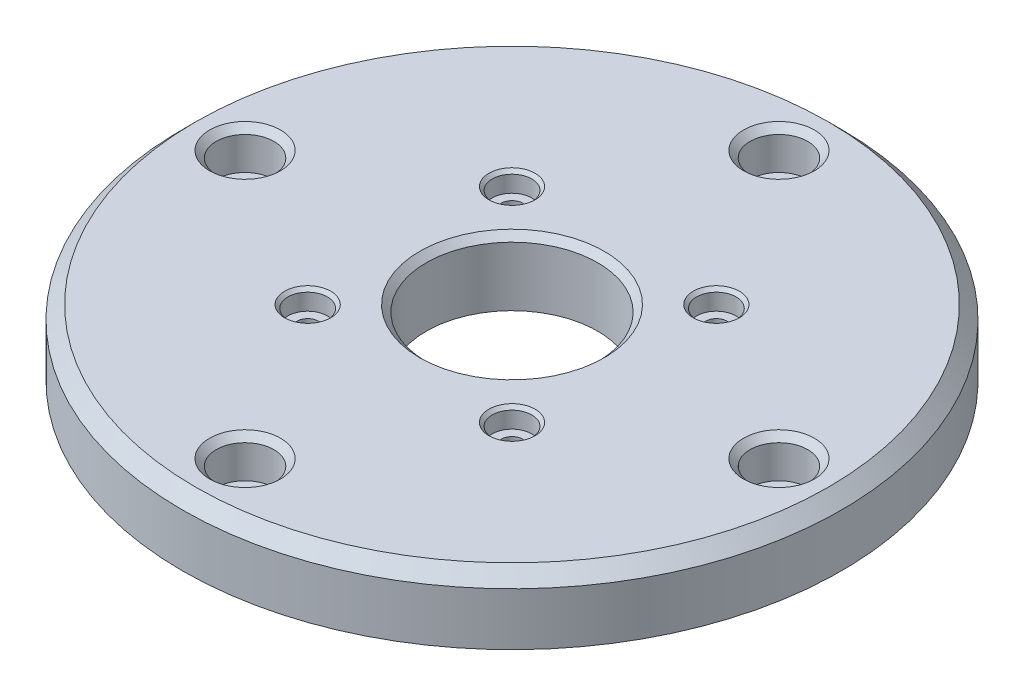
ISO-10303-21;
HEADER;
FILE_DESCRIPTION(('STEP AP214'),'2;1');
FILE_NAME('part.step','',(''),(''),'','','');
FILE_SCHEMA(('AUTOMOTIVE_DESIGN { 1 0 10303 214 1 1 1 1 }'));
ENDSEC;
DATA;
#1=APPLICATION_CONTEXT('core data for automotive mechanical design processes');
#2=APPLICATION_PROTOCOL_DEFINITION('international standard','automotive_design',2000,#1);
#3=PRODUCT_CONTEXT('',#1,'mechanical');
#4=PRODUCT('Part','Part','',(#3));
#5=PRODUCT_RELATED_PRODUCT_CATEGORY('part','',(#4));
#6=PRODUCT_DEFINITION_FORMATION('','',#4);
#7=PRODUCT_DEFINITION_CONTEXT('part definition',#1,'design');
#8=PRODUCT_DEFINITION('design','',#6,#7);
#9=PRODUCT_DEFINITION_SHAPE('','',#8);
#10=(LENGTH_UNIT() NAMED_UNIT(*) SI_UNIT(.MILLI.,.METRE.));
#11=(NAMED_UNIT(*) PLANE_ANGLE_UNIT() SI_UNIT($,.RADIAN.));
#12=(NAMED_UNIT(*) SI_UNIT($,.STERADIAN.) SOLID_ANGLE_UNIT());
#13=UNCERTAINTY_MEASURE_WITH_UNIT(LENGTH_MEASURE(1.E-05),#10,'distance_accuracy_value','');
#14=(GEOMETRIC_REPRESENTATION_CONTEXT(3) GLOBAL_UNCERTAINTY_ASSIGNED_CONTEXT((#13)) GLOBAL_UNIT_ASSIGNED_CONTEXT((#10,
#11,#12)) REPRESENTATION_CONTEXT('',''));
#15=CARTESIAN_POINT('',(0.,0.,0.));
#16=DIRECTION('',(0.,0.,1.));
#17=DIRECTION('',(1.,0.,0.));
#18=AXIS2_PLACEMENT_3D('',#15,#16,#17);
#19=CARTESIAN_POINT('',(40.5,10.,0.));
#20=DIRECTION('',(0.,-1.,0.));
#21=DIRECTION('',(0.,0.,-1.));
#22=AXIS2_PLACEMENT_3D('',#19,#20,#21);
#23=CYLINDRICAL_SURFACE('',#22,2.65);
#24=CARTESIAN_POINT('',(40.5,0.,0.));
#25=DIRECTION('',(0.,1.,0.));
#26=DIRECTION('',(0.,0.,1.));
#27=AXIS2_PLACEMENT_3D('',#24,#25,#26);
#28=CIRCLE('',#27,2.65);
#29=CARTESIAN_POINT('',(40.5,0.,2.65));
#30=VERTEX_POINT('',#29);
#31=EDGE_CURVE('E156',#30,#30,#28,.T.);
#32=ORIENTED_EDGE('',*,*,#31,.F.);
#33=EDGE_LOOP('',(#32));
#34=FACE_BOUND('',#33,.T.);
#35=CARTESIAN_POINT('',(40.5,4.,0.));
#36=DIRECTION('',(0.,1.,0.));
#37=DIRECTION('',(0.,0.,1.));
#38=AXIS2_PLACEMENT_3D('',#35,#36,#37);
#39=CIRCLE('',#38,2.65);
#40=CARTESIAN_POINT('',(40.5,4.,2.65));
#41=VERTEX_POINT('',#40);
#42=EDGE_CURVE('E99',#41,#41,#39,.T.);
#43=ORIENTED_EDGE('',*,*,#42,.T.);
#44=EDGE_LOOP('',(#43));
#45=FACE_BOUND('',#44,.T.);
#46=ADVANCED_FACE('F41',(#34,#45),#23,.F.);
#47=CARTESIAN_POINT('',(0.,10.,40.5));
#48=DIRECTION('',(0.,-1.,0.));
#49=DIRECTION('',(0.,0.,-1.));
#50=AXIS2_PLACEMENT_3D('',#47,#48,#49);
#51=CYLINDRICAL_SURFACE('',#50,2.65);
#52=CARTESIAN_POINT('',(0.,0.,40.5));
#53=DIRECTION('',(0.,1.,0.));
#54=DIRECTION('',(0.,0.,1.));
#55=AXIS2_PLACEMENT_3D('',#52,#53,#54);
#56=CIRCLE('',#55,2.65);
#57=CARTESIAN_POINT('',(0.,0.,43.15));
#58=VERTEX_POINT('',#57);
#59=EDGE_CURVE('E159',#58,#58,#56,.T.);
#60=ORIENTED_EDGE('',*,*,#59,.F.);
#61=EDGE_LOOP('',(#60));
#62=FACE_BOUND('',#61,.T.);
#63=CARTESIAN_POINT('',(0.,4.,40.5));
#64=DIRECTION('',(0.,1.,0.));
#65=DIRECTION('',(0.,0.,1.));
#66=AXIS2_PLACEMENT_3D('',#63,#64,#65);
#67=CIRCLE('',#66,2.65);
#68=CARTESIAN_POINT('',(0.,4.,43.15));
#69=VERTEX_POINT('',#68);
#70=EDGE_CURVE('E103',#69,#69,#67,.T.);
#71=ORIENTED_EDGE('',*,*,#70,.T.);
#72=EDGE_LOOP('',(#71));
#73=FACE_BOUND('',#72,.T.);
#74=ADVANCED_FACE('F207',(#62,#73),#51,.F.);
#75=CARTESIAN_POINT('',(-40.5,10.,0.));
#76=DIRECTION('',(0.,-1.,0.));
#77=DIRECTION('',(0.,0.,-1.));
#78=AXIS2_PLACEMENT_3D('',#75,#76,#77);
#79=CYLINDRICAL_SURFACE('',#78,2.65);
#80=CARTESIAN_POINT('',(-40.5,0.,0.));
#81=DIRECTION('',(0.,1.,0.));
#82=DIRECTION('',(0.,0.,1.));
#83=AXIS2_PLACEMENT_3D('',#80,#81,#82);
#84=CIRCLE('',#83,2.65);
#85=CARTESIAN_POINT('',(-40.5,0.,2.65));
#86=VERTEX_POINT('',#85);
#87=EDGE_CURVE('E162',#86,#86,#84,.T.);
#88=ORIENTED_EDGE('',*,*,#87,.F.);
#89=EDGE_LOOP('',(#88));
#90=FACE_BOUND('',#89,.T.);
#91=CARTESIAN_POINT('',(-40.5,4.,0.));
#92=DIRECTION('',(0.,1.,0.));
#93=DIRECTION('',(0.,0.,1.));
#94=AXIS2_PLACEMENT_3D('',#91,#92,#93);
#95=CIRCLE('',#94,2.65);
#96=CARTESIAN_POINT('',(-40.5,4.,2.65));
#97=VERTEX_POINT('',#96);
#98=EDGE_CURVE('E106',#97,#97,#95,.T.);
#99=ORIENTED_EDGE('',*,*,#98,.T.);
#100=EDGE_LOOP('',(#99));
#101=FACE_BOUND('',#100,.T.);
#102=ADVANCED_FACE('F213',(#90,#101),#79,.F.);
#103=CARTESIAN_POINT('',(0.,10.,-40.5));
#104=DIRECTION('',(0.,-1.,0.));
#105=DIRECTION('',(0.,0.,-1.));
#106=AXIS2_PLACEMENT_3D('',#103,#104,#105);
#107=CYLINDRICAL_SURFACE('',#106,2.65);
#108=CARTESIAN_POINT('',(0.,0.,-40.5));
#109=DIRECTION('',(0.,1.,0.));
#110=DIRECTION('',(0.,0.,1.));
#111=AXIS2_PLACEMENT_3D('',#108,#109,#110);
#112=CIRCLE('',#111,2.65);
#113=CARTESIAN_POINT('',(0.,0.,-37.85));
#114=VERTEX_POINT('',#113);
#115=EDGE_CURVE('E122',#114,#114,#112,.T.);
#116=ORIENTED_EDGE('',*,*,#115,.F.);
#117=EDGE_LOOP('',(#116));
#118=FACE_BOUND('',#117,.T.);
#119=CARTESIAN_POINT('',(0.,4.,-40.5));
#120=DIRECTION('',(0.,1.,0.));
#121=DIRECTION('',(0.,0.,1.));
#122=AXIS2_PLACEMENT_3D('',#119,#120,#121);
#123=CIRCLE('',#122,2.65);
#124=CARTESIAN_POINT('',(0.,4.,-37.85));
#125=VERTEX_POINT('',#124);
#126=EDGE_CURVE('E109',#125,#125,#123,.T.);
#127=ORIENTED_EDGE('',*,*,#126,.T.);
#128=EDGE_LOOP('',(#127));
#129=FACE_BOUND('',#128,.T.);
#130=ADVANCED_FACE('F267',(#118,#129),#107,.F.);
#131=CARTESIAN_POINT('',(0.,10.,0.));
#132=DIRECTION('',(0.,1.,0.));
#133=DIRECTION('',(0.,0.,1.));
#134=AXIS2_PLACEMENT_3D('',#131,#132,#133);
#135=CONICAL_SURFACE('',#134,14.,0.785398163397449);
#136=CARTESIAN_POINT('',(0.,10.,0.));
#137=DIRECTION('',(0.,1.,0.));
#138=DIRECTION('',(0.,0.,1.));
#139=AXIS2_PLACEMENT_3D('',#136,#137,#138);
#140=CIRCLE('',#139,14.);
#141=CARTESIAN_POINT('',(0.,10.,14.));
#142=VERTEX_POINT('',#141);
#143=EDGE_CURVE('E115',#142,#142,#140,.F.);
#144=ORIENTED_EDGE('',*,*,#143,.F.);
#145=EDGE_LOOP('',(#144));
#146=FACE_BOUND('',#145,.T.);
#147=CARTESIAN_POINT('',(0.,9.,0.));
#148=DIRECTION('',(0.,1.,0.));
#149=DIRECTION('',(0.,0.,1.));
#150=AXIS2_PLACEMENT_3D('',#147,#148,#149);
#151=CIRCLE('',#150,13.);
#152=CARTESIAN_POINT('',(0.,9.,13.));
#153=VERTEX_POINT('',#152);
#154=EDGE_CURVE('E98',#153,#153,#151,.T.);
#155=ORIENTED_EDGE('',*,*,#154,.F.);
#156=EDGE_LOOP('',(#155));
#157=FACE_BOUND('',#156,.T.);
#158=ADVANCED_FACE('F236',(#146,#157),#135,.F.);
#159=CARTESIAN_POINT('',(15.5,10.,-15.5));
#160=DIRECTION('',(0.,-1.,0.));
#161=DIRECTION('',(0.,0.,-1.));
#162=AXIS2_PLACEMENT_3D('',#159,#160,#161);
#163=CYLINDRICAL_SURFACE('',#162,1.625);
#164=CARTESIAN_POINT('',(15.5,0.,-15.5));
#165=DIRECTION('',(0.,1.,0.));
#166=DIRECTION('',(0.,0.,1.));
#167=AXIS2_PLACEMENT_3D('',#164,#165,#166);
#168=CIRCLE('',#167,1.625);
#169=CARTESIAN_POINT('',(15.5,0.,-13.875));
#170=VERTEX_POINT('',#169);
#171=EDGE_CURVE('E144',#170,#170,#168,.T.);
#172=ORIENTED_EDGE('',*,*,#171,.F.);
#173=EDGE_LOOP('',(#172));
#174=FACE_BOUND('',#173,.T.);
#175=CARTESIAN_POINT('',(15.5,7.,-15.5));
#176=DIRECTION('',(0.,1.,0.));
#177=DIRECTION('',(0.,0.,1.));
#178=AXIS2_PLACEMENT_3D('',#175,#176,#177);
#179=CIRCLE('',#178,1.625);
#180=CARTESIAN_POINT('',(15.5,7.,-13.875));
#181=VERTEX_POINT('',#180);
#182=EDGE_CURVE('E119',#181,#181,#179,.T.);
#183=ORIENTED_EDGE('',*,*,#182,.T.);
#184=EDGE_LOOP('',(#183));
#185=FACE_BOUND('',#184,.T.);
#186=ADVANCED_FACE('F232',(#174,#185),#163,.F.);
#187=CARTESIAN_POINT('',(15.5,10.,15.5));
#188=DIRECTION('',(0.,-1.,0.));
#189=DIRECTION('',(0.,0.,-1.));
#190=AXIS2_PLACEMENT_3D('',#187,#188,#189);
#191=CYLINDRICAL_SURFACE('',#190,1.625);
#192=CARTESIAN_POINT('',(15.5,0.,15.5));
#193=DIRECTION('',(0.,1.,0.));
#194=DIRECTION('',(0.,0.,1.));
#195=AXIS2_PLACEMENT_3D('',#192,#193,#194);
#196=CIRCLE('',#195,1.625);
#197=CARTESIAN_POINT('',(15.5,0.,17.125));
#198=VERTEX_POINT('',#197);
#199=EDGE_CURVE('E147',#198,#198,#196,.T.);
#200=ORIENTED_EDGE('',*,*,#199,.F.);
#201=EDGE_LOOP('',(#200));
#202=FACE_BOUND('',#201,.T.);
#203=CARTESIAN_POINT('',(15.5,7.,15.5));
#204=DIRECTION('',(0.,1.,0.));
#205=DIRECTION('',(0.,0.,1.));
#206=AXIS2_PLACEMENT_3D('',#203,#204,#205);
#207=CIRCLE('',#206,1.625);
#208=CARTESIAN_POINT('',(15.5,7.,17.125));
#209=VERTEX_POINT('',#208);
#210=EDGE_CURVE('E123',#209,#209,#207,.T.);
#211=ORIENTED_EDGE('',*,*,#210,.T.);
#212=EDGE_LOOP('',(#211));
#213=FACE_BOUND('',#212,.T.);
#214=ADVANCED_FACE('F228',(#202,#213),#191,.F.);
#215=CARTESIAN_POINT('',(-15.5,10.,15.5));
#216=DIRECTION('',(0.,-1.,0.));
#217=DIRECTION('',(0.,0.,-1.));
#218=AXIS2_PLACEMENT_3D('',#215,#216,#217);
#219=CYLINDRICAL_SURFACE('',#218,1.625);
#220=CARTESIAN_POINT('',(-15.5,0.,15.5));
#221=DIRECTION('',(0.,1.,0.));
#222=DIRECTION('',(0.,0.,1.));
#223=AXIS2_PLACEMENT_3D('',#220,#221,#222);
#224=CIRCLE('',#223,1.625);
#225=CARTESIAN_POINT('',(-15.5,0.,17.125));
#226=VERTEX_POINT('',#225);
#227=EDGE_CURVE('E150',#226,#226,#224,.T.);
#228=ORIENTED_EDGE('',*,*,#227,.F.);
#229=EDGE_LOOP('',(#228));
#230=FACE_BOUND('',#229,.T.);
#231=CARTESIAN_POINT('',(-15.5,7.,15.5));
#232=DIRECTION('',(0.,1.,0.));
#233=DIRECTION('',(0.,0.,1.));
#234=AXIS2_PLACEMENT_3D('',#231,#232,#233);
#235=CIRCLE('',#234,1.625);
#236=CARTESIAN_POINT('',(-15.5,7.,17.125));
#237=VERTEX_POINT('',#236);
#238=EDGE_CURVE('E126',#237,#237,#235,.T.);
#239=ORIENTED_EDGE('',*,*,#238,.T.);
#240=EDGE_LOOP('',(#239));
#241=FACE_BOUND('',#240,.T.);
#242=ADVANCED_FACE('F224',(#230,#241),#219,.F.);
#243=CARTESIAN_POINT('',(-15.5,10.,-15.5));
#244=DIRECTION('',(0.,-1.,0.));
#245=DIRECTION('',(0.,0.,-1.));
#246=AXIS2_PLACEMENT_3D('',#243,#244,#245);
#247=CYLINDRICAL_SURFACE('',#246,1.625);
#248=CARTESIAN_POINT('',(-15.5,0.,-15.5));
#249=DIRECTION('',(0.,1.,0.));
#250=DIRECTION('',(0.,0.,1.));
#251=AXIS2_PLACEMENT_3D('',#248,#249,#250);
#252=CIRCLE('',#251,1.625);
#253=CARTESIAN_POINT('',(-15.5,0.,-13.875));
#254=VERTEX_POINT('',#253);
#255=EDGE_CURVE('E153',#254,#254,#252,.T.);
#256=ORIENTED_EDGE('',*,*,#255,.F.);
#257=EDGE_LOOP('',(#256));
#258=FACE_BOUND('',#257,.T.);
#259=CARTESIAN_POINT('',(-15.5,7.,-15.5));
#260=DIRECTION('',(0.,1.,0.));
#261=DIRECTION('',(0.,0.,1.));
#262=AXIS2_PLACEMENT_3D('',#259,#260,#261);
#263=CIRCLE('',#262,1.625);
#264=CARTESIAN_POINT('',(-15.5,7.,-13.875));
#265=VERTEX_POINT('',#264);
#266=EDGE_CURVE('E129',#265,#265,#263,.T.);
#267=ORIENTED_EDGE('',*,*,#266,.T.);
#268=EDGE_LOOP('',(#267));
#269=FACE_BOUND('',#268,.T.);
#270=ADVANCED_FACE('F220',(#258,#269),#247,.F.);
#271=CARTESIAN_POINT('',(0.,10.,0.));
#272=DIRECTION('',(0.,-1.,0.));
#273=DIRECTION('',(0.,0.,-1.));
#274=AXIS2_PLACEMENT_3D('',#271,#272,#273);
#275=CONICAL_SURFACE('',#274,48.,0.785398163397449);
#276=CARTESIAN_POINT('',(0.,10.,0.));
#277=DIRECTION('',(0.,1.,0.));
#278=DIRECTION('',(0.,0.,1.));
#279=AXIS2_PLACEMENT_3D('',#276,#277,#278);
#280=CIRCLE('',#279,48.);
#281=CARTESIAN_POINT('',(0.,10.,48.));
#282=VERTEX_POINT('',#281);
#283=EDGE_CURVE('E135',#282,#282,#280,.T.);
#284=ORIENTED_EDGE('',*,*,#283,.F.);
#285=EDGE_LOOP('',(#284));
#286=FACE_BOUND('',#285,.T.);
#287=CARTESIAN_POINT('',(0.,8.,0.));
#288=DIRECTION('',(0.,1.,0.));
#289=DIRECTION('',(0.,0.,1.));
#290=AXIS2_PLACEMENT_3D('',#287,#288,#289);
#291=CIRCLE('',#290,50.);
#292=CARTESIAN_POINT('',(0.,8.,50.));
#293=VERTEX_POINT('',#292);
#294=EDGE_CURVE('E118',#293,#293,#291,.F.);
#295=ORIENTED_EDGE('',*,*,#294,.F.);
#296=EDGE_LOOP('',(#295));
#297=FACE_BOUND('',#296,.T.);
#298=ADVANCED_FACE('F223',(#286,#297),#275,.T.);
#299=CARTESIAN_POINT('',(0.,10.,0.));
#300=DIRECTION('',(0.,1.,0.));
#301=DIRECTION('',(0.,0.,1.));
#302=AXIS2_PLACEMENT_3D('',#299,#300,#301);
#303=PLANE('',#302);
#304=CARTESIAN_POINT('',(-15.5,10.,15.5));
#305=DIRECTION('',(0.,1.,0.));
#306=DIRECTION('',(0.,0.,1.));
#307=AXIS2_PLACEMENT_3D('',#304,#305,#306);
#308=CIRCLE('',#307,3.5);
#309=CARTESIAN_POINT('',(-15.5,10.,19.));
#310=VERTEX_POINT('',#309);
#311=EDGE_CURVE('E57',#310,#310,#308,.F.);
#312=ORIENTED_EDGE('',*,*,#311,.T.);
#313=EDGE_LOOP('',(#312));
#314=FACE_BOUND('',#313,.T.);
#315=CARTESIAN_POINT('',(15.5,10.,15.5));
#316=DIRECTION('',(0.,1.,0.));
#317=DIRECTION('',(0.,0.,1.));
#318=AXIS2_PLACEMENT_3D('',#315,#316,#317);
#319=CIRCLE('',#318,3.5);
#320=CARTESIAN_POINT('',(15.5,10.,19.));
#321=VERTEX_POINT('',#320);
#322=EDGE_CURVE('E62',#321,#321,#319,.F.);
#323=ORIENTED_EDGE('',*,*,#322,.T.);
#324=EDGE_LOOP('',(#323));
#325=FACE_BOUND('',#324,.T.);
#326=CARTESIAN_POINT('',(15.5,10.,-15.5));
#327=DIRECTION('',(0.,1.,0.));
#328=DIRECTION('',(0.,0.,1.));
#329=AXIS2_PLACEMENT_3D('',#326,#327,#328);
#330=CIRCLE('',#329,3.5);
#331=CARTESIAN_POINT('',(15.5,10.,-12.));
#332=VERTEX_POINT('',#331);
#333=EDGE_CURVE('E65',#332,#332,#330,.F.);
#334=ORIENTED_EDGE('',*,*,#333,.T.);
#335=EDGE_LOOP('',(#334));
#336=FACE_BOUND('',#335,.T.);
#337=CARTESIAN_POINT('',(-15.5,10.,-15.5));
#338=DIRECTION('',(0.,1.,0.));
#339=DIRECTION('',(0.,0.,1.));
#340=AXIS2_PLACEMENT_3D('',#337,#338,#339);
#341=CIRCLE('',#340,3.5);
#342=CARTESIAN_POINT('',(-15.5,10.,-12.));
#343=VERTEX_POINT('',#342);
#344=EDGE_CURVE('E68',#343,#343,#341,.F.);
#345=ORIENTED_EDGE('',*,*,#344,.T.);
#346=EDGE_LOOP('',(#345));
#347=FACE_BOUND('',#346,.T.);
#348=CARTESIAN_POINT('',(0.,10.,-40.5));
#349=DIRECTION('',(0.,1.,0.));
#350=DIRECTION('',(0.,0.,1.));
#351=AXIS2_PLACEMENT_3D('',#348,#349,#350);
#352=CIRCLE('',#351,5.375);
#353=CARTESIAN_POINT('',(0.,10.,-35.125));
#354=VERTEX_POINT('',#353);
#355=EDGE_CURVE('E83',#354,#354,#352,.F.);
#356=ORIENTED_EDGE('',*,*,#355,.T.);
#357=EDGE_LOOP('',(#356));
#358=FACE_BOUND('',#357,.T.);
#359=CARTESIAN_POINT('',(-40.5,10.,0.));
#360=DIRECTION('',(0.,1.,0.));
#361=DIRECTION('',(0.,0.,1.));
#362=AXIS2_PLACEMENT_3D('',#359,#360,#361);
#363=CIRCLE('',#362,5.375);
#364=CARTESIAN_POINT('',(-40.5,10.,5.375));
#365=VERTEX_POINT('',#364);
#366=EDGE_CURVE('E86',#365,#365,#363,.F.);
#367=ORIENTED_EDGE('',*,*,#366,.T.);
#368=EDGE_LOOP('',(#367));
#369=FACE_BOUND('',#368,.T.);
#370=CARTESIAN_POINT('',(0.,10.,40.5));
#371=DIRECTION('',(0.,1.,0.));
#372=DIRECTION('',(0.,0.,1.));
#373=AXIS2_PLACEMENT_3D('',#370,#371,#372);
#374=CIRCLE('',#373,5.37499999999998);
#375=CARTESIAN_POINT('',(0.,10.,45.875));
#376=VERTEX_POINT('',#375);
#377=EDGE_CURVE('E89',#376,#376,#374,.F.);
#378=ORIENTED_EDGE('',*,*,#377,.T.);
#379=EDGE_LOOP('',(#378));
#380=FACE_BOUND('',#379,.T.);
#381=CARTESIAN_POINT('',(40.5,10.,0.));
#382=DIRECTION('',(0.,1.,0.));
#383=DIRECTION('',(0.,0.,1.));
#384=AXIS2_PLACEMENT_3D('',#381,#382,#383);
#385=CIRCLE('',#384,5.375);
#386=CARTESIAN_POINT('',(40.5,10.,5.375));
#387=VERTEX_POINT('',#386);
#388=EDGE_CURVE('E92',#387,#387,#385,.F.);
#389=ORIENTED_EDGE('',*,*,#388,.T.);
#390=EDGE_LOOP('',(#389));
#391=FACE_BOUND('',#390,.T.);
#392=ORIENTED_EDGE('',*,*,#143,.T.);
#393=EDGE_LOOP('',(#392));
#394=FACE_BOUND('',#393,.T.);
#395=ORIENTED_EDGE('',*,*,#283,.T.);
#396=EDGE_LOOP('',(#395));
#397=FACE_BOUND('',#396,.T.);
#398=ADVANCED_FACE('F244',(#314,#325,#336,#347,#358,#369,#380,#391,#394,#397),#303,.T.);
#399=CARTESIAN_POINT('',(0.,0.,0.));
#400=DIRECTION('',(0.,1.,0.));
#401=DIRECTION('',(0.,0.,1.));
#402=AXIS2_PLACEMENT_3D('',#399,#400,#401);
#403=PLANE('',#402);
#404=CARTESIAN_POINT('',(0.,0.,0.));
#405=DIRECTION('',(0.,1.,0.));
#406=DIRECTION('',(0.,0.,1.));
#407=AXIS2_PLACEMENT_3D('',#404,#405,#406);
#408=CIRCLE('',#407,50.);
#409=CARTESIAN_POINT('',(0.,0.,50.));
#410=VERTEX_POINT('',#409);
#411=EDGE_CURVE('E138',#410,#410,#408,.T.);
#412=ORIENTED_EDGE('',*,*,#411,.F.);
#413=EDGE_LOOP('',(#412));
#414=FACE_BOUND('',#413,.T.);
#415=CARTESIAN_POINT('',(0.,0.,0.));
#416=DIRECTION('',(0.,1.,0.));
#417=DIRECTION('',(0.,0.,1.));
#418=AXIS2_PLACEMENT_3D('',#415,#416,#417);
#419=CIRCLE('',#418,13.);
#420=CARTESIAN_POINT('',(0.,0.,13.));
#421=VERTEX_POINT('',#420);
#422=EDGE_CURVE('E141',#421,#421,#419,.T.);
#423=ORIENTED_EDGE('',*,*,#422,.T.);
#424=EDGE_LOOP('',(#423));
#425=FACE_BOUND('',#424,.T.);
#426=ORIENTED_EDGE('',*,*,#171,.T.);
#427=EDGE_LOOP('',(#426));
#428=FACE_BOUND('',#427,.T.);
#429=ORIENTED_EDGE('',*,*,#199,.T.);
#430=EDGE_LOOP('',(#429));
#431=FACE_BOUND('',#430,.T.);
#432=ORIENTED_EDGE('',*,*,#227,.T.);
#433=EDGE_LOOP('',(#432));
#434=FACE_BOUND('',#433,.T.);
#435=ORIENTED_EDGE('',*,*,#255,.T.);
#436=EDGE_LOOP('',(#435));
#437=FACE_BOUND('',#436,.T.);
#438=ORIENTED_EDGE('',*,*,#31,.T.);
#439=EDGE_LOOP('',(#438));
#440=FACE_BOUND('',#439,.T.);
#441=ORIENTED_EDGE('',*,*,#59,.T.);
#442=EDGE_LOOP('',(#441));
#443=FACE_BOUND('',#442,.T.);
#444=ORIENTED_EDGE('',*,*,#87,.T.);
#445=EDGE_LOOP('',(#444));
#446=FACE_BOUND('',#445,.T.);
#447=ORIENTED_EDGE('',*,*,#115,.T.);
#448=EDGE_LOOP('',(#447));
#449=FACE_BOUND('',#448,.T.);
#450=ADVANCED_FACE('F247',(#414,#425,#428,#431,#434,#437,#440,#443,#446,#449),#403,.F.);
#451=CARTESIAN_POINT('',(0.,10.,0.));
#452=DIRECTION('',(0.,-1.,0.));
#453=DIRECTION('',(0.,0.,-1.));
#454=AXIS2_PLACEMENT_3D('',#451,#452,#453);
#455=CYLINDRICAL_SURFACE('',#454,50.);
#456=ORIENTED_EDGE('',*,*,#294,.T.);
#457=EDGE_LOOP('',(#456));
#458=FACE_BOUND('',#457,.T.);
#459=ORIENTED_EDGE('',*,*,#411,.T.);
#460=EDGE_LOOP('',(#459));
#461=FACE_BOUND('',#460,.T.);
#462=ADVANCED_FACE('F242',(#458,#461),#455,.T.);
#463=CARTESIAN_POINT('',(0.,10.,0.));
#464=DIRECTION('',(0.,-1.,0.));
#465=DIRECTION('',(0.,0.,-1.));
#466=AXIS2_PLACEMENT_3D('',#463,#464,#465);
#467=CYLINDRICAL_SURFACE('',#466,13.);
#468=ORIENTED_EDGE('',*,*,#154,.T.);
#469=EDGE_LOOP('',(#468));
#470=FACE_BOUND('',#469,.T.);
#471=ORIENTED_EDGE('',*,*,#422,.F.);
#472=EDGE_LOOP('',(#471));
#473=FACE_BOUND('',#472,.T.);
#474=ADVANCED_FACE('F238',(#470,#473),#467,.F.);
#475=CARTESIAN_POINT('',(-15.5,7.,-15.5));
#476=DIRECTION('',(0.,1.,0.));
#477=DIRECTION('',(0.,0.,1.));
#478=AXIS2_PLACEMENT_3D('',#475,#476,#477);
#479=CYLINDRICAL_SURFACE('',#478,3.);
#480=CARTESIAN_POINT('',(-15.5,9.5,-15.5));
#481=DIRECTION('',(0.,1.,0.));
#482=DIRECTION('',(0.,0.,1.));
#483=AXIS2_PLACEMENT_3D('',#480,#481,#482);
#484=CIRCLE('',#483,3.);
#485=CARTESIAN_POINT('',(-15.5,9.5,-12.5));
#486=VERTEX_POINT('',#485);
#487=EDGE_CURVE('E12',#486,#486,#484,.T.);
#488=ORIENTED_EDGE('',*,*,#487,.T.);
#489=EDGE_LOOP('',(#488));
#490=FACE_BOUND('',#489,.T.);
#491=CARTESIAN_POINT('',(-15.5,7.,-15.5));
#492=DIRECTION('',(0.,1.,0.));
#493=DIRECTION('',(0.,0.,1.));
#494=AXIS2_PLACEMENT_3D('',#491,#492,#493);
#495=CIRCLE('',#494,3.);
#496=CARTESIAN_POINT('',(-15.5,7.,-12.5));
#497=VERTEX_POINT('',#496);
#498=EDGE_CURVE('E132',#497,#497,#495,.T.);
#499=ORIENTED_EDGE('',*,*,#498,.F.);
#500=EDGE_LOOP('',(#499));
#501=FACE_BOUND('',#500,.T.);
#502=ADVANCED_FACE('F241',(#490,#501),#479,.F.);
#503=CARTESIAN_POINT('',(-15.5,7.,-15.5));
#504=DIRECTION('',(0.,1.,0.));
#505=DIRECTION('',(0.,0.,1.));
#506=AXIS2_PLACEMENT_3D('',#503,#504,#505);
#507=PLANE('',#506);
#508=ORIENTED_EDGE('',*,*,#266,.F.);
#509=EDGE_LOOP('',(#508));
#510=FACE_BOUND('',#509,.T.);
#511=ORIENTED_EDGE('',*,*,#498,.T.);
#512=EDGE_LOOP('',(#511));
#513=FACE_BOUND('',#512,.T.);
#514=ADVANCED_FACE('F399',(#510,#513),#507,.T.);
#515=CARTESIAN_POINT('',(-15.5,7.,15.5));
#516=DIRECTION('',(0.,1.,0.));
#517=DIRECTION('',(0.,0.,1.));
#518=AXIS2_PLACEMENT_3D('',#515,#516,#517);
#519=CYLINDRICAL_SURFACE('',#518,3.);
#520=CARTESIAN_POINT('',(-15.5,9.5,15.5));
#521=DIRECTION('',(0.,1.,0.));
#522=DIRECTION('',(0.,0.,1.));
#523=AXIS2_PLACEMENT_3D('',#520,#521,#522);
#524=CIRCLE('',#523,3.);
#525=CARTESIAN_POINT('',(-15.5,9.5,18.5));
#526=VERTEX_POINT('',#525);
#527=EDGE_CURVE('E71',#526,#526,#524,.T.);
#528=ORIENTED_EDGE('',*,*,#527,.T.);
#529=EDGE_LOOP('',(#528));
#530=FACE_BOUND('',#529,.T.);
#531=CARTESIAN_POINT('',(-15.5,7.,15.5));
#532=DIRECTION('',(0.,1.,0.));
#533=DIRECTION('',(0.,0.,1.));
#534=AXIS2_PLACEMENT_3D('',#531,#532,#533);
#535=CIRCLE('',#534,3.);
#536=CARTESIAN_POINT('',(-15.5,7.,18.5));
#537=VERTEX_POINT('',#536);
#538=EDGE_CURVE('E102',#537,#537,#535,.T.);
#539=ORIENTED_EDGE('',*,*,#538,.F.);
#540=EDGE_LOOP('',(#539));
#541=FACE_BOUND('',#540,.T.);
#542=ADVANCED_FACE('F395',(#530,#541),#519,.F.);
#543=CARTESIAN_POINT('',(-15.5,7.,15.5));
#544=DIRECTION('',(0.,1.,0.));
#545=DIRECTION('',(0.,0.,1.));
#546=AXIS2_PLACEMENT_3D('',#543,#544,#545);
#547=PLANE('',#546);
#548=ORIENTED_EDGE('',*,*,#238,.F.);
#549=EDGE_LOOP('',(#548));
#550=FACE_BOUND('',#549,.T.);
#551=ORIENTED_EDGE('',*,*,#538,.T.);
#552=EDGE_LOOP('',(#551));
#553=FACE_BOUND('',#552,.T.);
#554=ADVANCED_FACE('F391',(#550,#553),#547,.T.);
#555=CARTESIAN_POINT('',(15.5,7.,15.5));
#556=DIRECTION('',(0.,1.,0.));
#557=DIRECTION('',(0.,0.,1.));
#558=AXIS2_PLACEMENT_3D('',#555,#556,#557);
#559=CYLINDRICAL_SURFACE('',#558,3.);
#560=CARTESIAN_POINT('',(15.5,9.5,15.5));
#561=DIRECTION('',(0.,1.,0.));
#562=DIRECTION('',(0.,0.,1.));
#563=AXIS2_PLACEMENT_3D('',#560,#561,#562);
#564=CIRCLE('',#563,3.);
#565=CARTESIAN_POINT('',(15.5,9.5,18.5));
#566=VERTEX_POINT('',#565);
#567=EDGE_CURVE('E53',#566,#566,#564,.T.);
#568=ORIENTED_EDGE('',*,*,#567,.T.);
#569=EDGE_LOOP('',(#568));
#570=FACE_BOUND('',#569,.T.);
#571=CARTESIAN_POINT('',(15.5,7.,15.5));
#572=DIRECTION('',(0.,1.,0.));
#573=DIRECTION('',(0.,0.,1.));
#574=AXIS2_PLACEMENT_3D('',#571,#572,#573);
#575=CIRCLE('',#574,3.);
#576=CARTESIAN_POINT('',(15.5,7.,18.5));
#577=VERTEX_POINT('',#576);
#578=EDGE_CURVE('E172',#577,#577,#575,.T.);
#579=ORIENTED_EDGE('',*,*,#578,.F.);
#580=EDGE_LOOP('',(#579));
#581=FACE_BOUND('',#580,.T.);
#582=ADVANCED_FACE('F387',(#570,#581),#559,.F.);
#583=CARTESIAN_POINT('',(15.5,7.,15.5));
#584=DIRECTION('',(0.,1.,0.));
#585=DIRECTION('',(0.,0.,1.));
#586=AXIS2_PLACEMENT_3D('',#583,#584,#585);
#587=PLANE('',#586);
#588=ORIENTED_EDGE('',*,*,#210,.F.);
#589=EDGE_LOOP('',(#588));
#590=FACE_BOUND('',#589,.T.);
#591=ORIENTED_EDGE('',*,*,#578,.T.);
#592=EDGE_LOOP('',(#591));
#593=FACE_BOUND('',#592,.T.);
#594=ADVANCED_FACE('F384',(#590,#593),#587,.T.);
#595=CARTESIAN_POINT('',(15.5,7.,-15.5));
#596=DIRECTION('',(0.,1.,0.));
#597=DIRECTION('',(0.,0.,1.));
#598=AXIS2_PLACEMENT_3D('',#595,#596,#597);
#599=CYLINDRICAL_SURFACE('',#598,3.);
#600=CARTESIAN_POINT('',(15.5,9.5,-15.5));
#601=DIRECTION('',(0.,1.,0.));
#602=DIRECTION('',(0.,0.,1.));
#603=AXIS2_PLACEMENT_3D('',#600,#601,#602);
#604=CIRCLE('',#603,3.);
#605=CARTESIAN_POINT('',(15.5,9.5,-12.5));
#606=VERTEX_POINT('',#605);
#607=EDGE_CURVE('E49',#606,#606,#604,.T.);
#608=ORIENTED_EDGE('',*,*,#607,.T.);
#609=EDGE_LOOP('',(#608));
#610=FACE_BOUND('',#609,.T.);
#611=CARTESIAN_POINT('',(15.5,7.,-15.5));
#612=DIRECTION('',(0.,1.,0.));
#613=DIRECTION('',(0.,0.,1.));
#614=AXIS2_PLACEMENT_3D('',#611,#612,#613);
#615=CIRCLE('',#614,3.);
#616=CARTESIAN_POINT('',(15.5,7.,-12.5));
#617=VERTEX_POINT('',#616);
#618=EDGE_CURVE('E169',#617,#617,#615,.T.);
#619=ORIENTED_EDGE('',*,*,#618,.F.);
#620=EDGE_LOOP('',(#619));
#621=FACE_BOUND('',#620,.T.);
#622=ADVANCED_FACE('F377',(#610,#621),#599,.F.);
#623=CARTESIAN_POINT('',(15.5,7.,-15.5));
#624=DIRECTION('',(0.,1.,0.));
#625=DIRECTION('',(0.,0.,1.));
#626=AXIS2_PLACEMENT_3D('',#623,#624,#625);
#627=PLANE('',#626);
#628=ORIENTED_EDGE('',*,*,#182,.F.);
#629=EDGE_LOOP('',(#628));
#630=FACE_BOUND('',#629,.T.);
#631=ORIENTED_EDGE('',*,*,#618,.T.);
#632=EDGE_LOOP('',(#631));
#633=FACE_BOUND('',#632,.T.);
#634=ADVANCED_FACE('F371',(#630,#633),#627,.T.);
#635=CARTESIAN_POINT('',(0.,4.,-40.5));
#636=DIRECTION('',(0.,1.,0.));
#637=DIRECTION('',(0.,0.,1.));
#638=AXIS2_PLACEMENT_3D('',#635,#636,#637);
#639=CYLINDRICAL_SURFACE('',#638,4.375);
#640=CARTESIAN_POINT('',(0.,9.,-40.5));
#641=DIRECTION('',(0.,1.,0.));
#642=DIRECTION('',(0.,0.,1.));
#643=AXIS2_PLACEMENT_3D('',#640,#641,#642);
#644=CIRCLE('',#643,4.375);
#645=CARTESIAN_POINT('',(0.,9.,-36.125));
#646=VERTEX_POINT('',#645);
#647=EDGE_CURVE('E95',#646,#646,#644,.T.);
#648=ORIENTED_EDGE('',*,*,#647,.T.);
#649=EDGE_LOOP('',(#648));
#650=FACE_BOUND('',#649,.T.);
#651=CARTESIAN_POINT('',(0.,4.,-40.5));
#652=DIRECTION('',(0.,1.,0.));
#653=DIRECTION('',(0.,0.,1.));
#654=AXIS2_PLACEMENT_3D('',#651,#652,#653);
#655=CIRCLE('',#654,4.375);
#656=CARTESIAN_POINT('',(0.,4.,-36.125));
#657=VERTEX_POINT('',#656);
#658=EDGE_CURVE('E177',#657,#657,#655,.T.);
#659=ORIENTED_EDGE('',*,*,#658,.F.);
#660=EDGE_LOOP('',(#659));
#661=FACE_BOUND('',#660,.T.);
#662=ADVANCED_FACE('F366',(#650,#661),#639,.F.);
#663=CARTESIAN_POINT('',(0.,4.,-40.5));
#664=DIRECTION('',(0.,1.,0.));
#665=DIRECTION('',(0.,0.,1.));
#666=AXIS2_PLACEMENT_3D('',#663,#664,#665);
#667=PLANE('',#666);
#668=ORIENTED_EDGE('',*,*,#126,.F.);
#669=EDGE_LOOP('',(#668));
#670=FACE_BOUND('',#669,.T.);
#671=ORIENTED_EDGE('',*,*,#658,.T.);
#672=EDGE_LOOP('',(#671));
#673=FACE_BOUND('',#672,.T.);
#674=ADVANCED_FACE('F362',(#670,#673),#667,.T.);
#675=CARTESIAN_POINT('',(-40.5,4.,0.));
#676=DIRECTION('',(0.,1.,0.));
#677=DIRECTION('',(0.,0.,1.));
#678=AXIS2_PLACEMENT_3D('',#675,#676,#677);
#679=CYLINDRICAL_SURFACE('',#678,4.37500000000001);
#680=CARTESIAN_POINT('',(-40.5,9.,0.));
#681=DIRECTION('',(0.,1.,0.));
#682=DIRECTION('',(0.,0.,1.));
#683=AXIS2_PLACEMENT_3D('',#680,#681,#682);
#684=CIRCLE('',#683,4.37500000000001);
#685=CARTESIAN_POINT('',(-40.5,9.,4.375));
#686=VERTEX_POINT('',#685);
#687=EDGE_CURVE('E80',#686,#686,#684,.T.);
#688=ORIENTED_EDGE('',*,*,#687,.T.);
#689=EDGE_LOOP('',(#688));
#690=FACE_BOUND('',#689,.T.);
#691=CARTESIAN_POINT('',(-40.5,4.,0.));
#692=DIRECTION('',(0.,1.,0.));
#693=DIRECTION('',(0.,0.,1.));
#694=AXIS2_PLACEMENT_3D('',#691,#692,#693);
#695=CIRCLE('',#694,4.37500000000001);
#696=CARTESIAN_POINT('',(-40.5,4.,4.375));
#697=VERTEX_POINT('',#696);
#698=EDGE_CURVE('E180',#697,#697,#695,.T.);
#699=ORIENTED_EDGE('',*,*,#698,.F.);
#700=EDGE_LOOP('',(#699));
#701=FACE_BOUND('',#700,.T.);
#702=ADVANCED_FACE('F365',(#690,#701),#679,.F.);
#703=CARTESIAN_POINT('',(-40.5,4.,0.));
#704=DIRECTION('',(0.,1.,0.));
#705=DIRECTION('',(0.,0.,1.));
#706=AXIS2_PLACEMENT_3D('',#703,#704,#705);
#707=PLANE('',#706);
#708=ORIENTED_EDGE('',*,*,#98,.F.);
#709=EDGE_LOOP('',(#708));
#710=FACE_BOUND('',#709,.T.);
#711=ORIENTED_EDGE('',*,*,#698,.T.);
#712=EDGE_LOOP('',(#711));
#713=FACE_BOUND('',#712,.T.);
#714=ADVANCED_FACE('F412',(#710,#713),#707,.T.);
#715=CARTESIAN_POINT('',(0.,4.,40.5));
#716=DIRECTION('',(0.,1.,0.));
#717=DIRECTION('',(0.,0.,1.));
#718=AXIS2_PLACEMENT_3D('',#715,#716,#717);
#719=CYLINDRICAL_SURFACE('',#718,4.37499999999999);
#720=CARTESIAN_POINT('',(0.,9.00000000000002,40.5));
#721=DIRECTION('',(0.,1.,0.));
#722=DIRECTION('',(0.,0.,1.));
#723=AXIS2_PLACEMENT_3D('',#720,#721,#722);
#724=CIRCLE('',#723,4.37499999999999);
#725=CARTESIAN_POINT('',(0.,9.00000000000002,44.875));
#726=VERTEX_POINT('',#725);
#727=EDGE_CURVE('E77',#726,#726,#724,.T.);
#728=ORIENTED_EDGE('',*,*,#727,.T.);
#729=EDGE_LOOP('',(#728));
#730=FACE_BOUND('',#729,.T.);
#731=CARTESIAN_POINT('',(0.,4.,40.5));
#732=DIRECTION('',(0.,1.,0.));
#733=DIRECTION('',(0.,0.,1.));
#734=AXIS2_PLACEMENT_3D('',#731,#732,#733);
#735=CIRCLE('',#734,4.37499999999999);
#736=CARTESIAN_POINT('',(0.,4.,44.875));
#737=VERTEX_POINT('',#736);
#738=EDGE_CURVE('E183',#737,#737,#735,.T.);
#739=ORIENTED_EDGE('',*,*,#738,.F.);
#740=EDGE_LOOP('',(#739));
#741=FACE_BOUND('',#740,.T.);
#742=ADVANCED_FACE('F203',(#730,#741),#719,.F.);
#743=CARTESIAN_POINT('',(0.,4.,40.5));
#744=DIRECTION('',(0.,1.,0.));
#745=DIRECTION('',(0.,0.,1.));
#746=AXIS2_PLACEMENT_3D('',#743,#744,#745);
#747=PLANE('',#746);
#748=ORIENTED_EDGE('',*,*,#70,.F.);
#749=EDGE_LOOP('',(#748));
#750=FACE_BOUND('',#749,.T.);
#751=ORIENTED_EDGE('',*,*,#738,.T.);
#752=EDGE_LOOP('',(#751));
#753=FACE_BOUND('',#752,.T.);
#754=ADVANCED_FACE('F193',(#750,#753),#747,.T.);
#755=CARTESIAN_POINT('',(40.5,4.,0.));
#756=DIRECTION('',(0.,1.,0.));
#757=DIRECTION('',(0.,0.,1.));
#758=AXIS2_PLACEMENT_3D('',#755,#756,#757);
#759=CYLINDRICAL_SURFACE('',#758,4.375);
#760=CARTESIAN_POINT('',(40.5,8.99999999999999,0.));
#761=DIRECTION('',(0.,1.,0.));
#762=DIRECTION('',(0.,0.,1.));
#763=AXIS2_PLACEMENT_3D('',#760,#761,#762);
#764=CIRCLE('',#763,4.375);
#765=CARTESIAN_POINT('',(40.5,8.99999999999999,4.375));
#766=VERTEX_POINT('',#765);
#767=EDGE_CURVE('E74',#766,#766,#764,.T.);
#768=ORIENTED_EDGE('',*,*,#767,.T.);
#769=EDGE_LOOP('',(#768));
#770=FACE_BOUND('',#769,.T.);
#771=CARTESIAN_POINT('',(40.5,4.,0.));
#772=DIRECTION('',(0.,1.,0.));
#773=DIRECTION('',(0.,0.,1.));
#774=AXIS2_PLACEMENT_3D('',#771,#772,#773);
#775=CIRCLE('',#774,4.375);
#776=CARTESIAN_POINT('',(40.5,4.,4.375));
#777=VERTEX_POINT('',#776);
#778=EDGE_CURVE('E112',#777,#777,#775,.T.);
#779=ORIENTED_EDGE('',*,*,#778,.F.);
#780=EDGE_LOOP('',(#779));
#781=FACE_BOUND('',#780,.T.);
#782=ADVANCED_FACE('F191',(#770,#781),#759,.F.);
#783=CARTESIAN_POINT('',(40.5,4.,0.));
#784=DIRECTION('',(0.,1.,0.));
#785=DIRECTION('',(0.,0.,1.));
#786=AXIS2_PLACEMENT_3D('',#783,#784,#785);
#787=PLANE('',#786);
#788=ORIENTED_EDGE('',*,*,#42,.F.);
#789=EDGE_LOOP('',(#788));
#790=FACE_BOUND('',#789,.T.);
#791=ORIENTED_EDGE('',*,*,#778,.T.);
#792=EDGE_LOOP('',(#791));
#793=FACE_BOUND('',#792,.T.);
#794=ADVANCED_FACE('F189',(#790,#793),#787,.T.);
#795=CARTESIAN_POINT('',(0.,9.,-40.5));
#796=DIRECTION('',(0.,1.,0.));
#797=DIRECTION('',(0.,0.,1.));
#798=AXIS2_PLACEMENT_3D('',#795,#796,#797);
#799=CONICAL_SURFACE('',#798,4.375,0.785398163397447);
#800=ORIENTED_EDGE('',*,*,#355,.F.);
#801=EDGE_LOOP('',(#800));
#802=FACE_BOUND('',#801,.T.);
#803=ORIENTED_EDGE('',*,*,#647,.F.);
#804=EDGE_LOOP('',(#803));
#805=FACE_BOUND('',#804,.T.);
#806=ADVANCED_FACE('F200',(#802,#805),#799,.F.);
#807=CARTESIAN_POINT('',(-40.5,9.,0.));
#808=DIRECTION('',(0.,1.,0.));
#809=DIRECTION('',(0.,0.,1.));
#810=AXIS2_PLACEMENT_3D('',#807,#808,#809);
#811=CONICAL_SURFACE('',#810,4.37500000000001,0.785398163397447);
#812=ORIENTED_EDGE('',*,*,#366,.F.);
#813=EDGE_LOOP('',(#812));
#814=FACE_BOUND('',#813,.T.);
#815=ORIENTED_EDGE('',*,*,#687,.F.);
#816=EDGE_LOOP('',(#815));
#817=FACE_BOUND('',#816,.T.);
#818=ADVANCED_FACE('F274',(#814,#817),#811,.F.);
#819=CARTESIAN_POINT('',(0.,9.00000000000002,40.5));
#820=DIRECTION('',(0.,1.,0.));
#821=DIRECTION('',(0.,0.,1.));
#822=AXIS2_PLACEMENT_3D('',#819,#820,#821);
#823=CONICAL_SURFACE('',#822,4.37499999999999,0.785398163397455);
#824=ORIENTED_EDGE('',*,*,#377,.F.);
#825=EDGE_LOOP('',(#824));
#826=FACE_BOUND('',#825,.T.);
#827=ORIENTED_EDGE('',*,*,#727,.F.);
#828=EDGE_LOOP('',(#827));
#829=FACE_BOUND('',#828,.T.);
#830=ADVANCED_FACE('F281',(#826,#829),#823,.F.);
#831=CARTESIAN_POINT('',(40.5,8.99999999999999,0.));
#832=DIRECTION('',(0.,1.,0.));
#833=DIRECTION('',(0.,0.,1.));
#834=AXIS2_PLACEMENT_3D('',#831,#832,#833);
#835=CONICAL_SURFACE('',#834,4.375,0.785398163397448);
#836=ORIENTED_EDGE('',*,*,#388,.F.);
#837=EDGE_LOOP('',(#836));
#838=FACE_BOUND('',#837,.T.);
#839=ORIENTED_EDGE('',*,*,#767,.F.);
#840=EDGE_LOOP('',(#839));
#841=FACE_BOUND('',#840,.T.);
#842=ADVANCED_FACE('F288',(#838,#841),#835,.F.);
#843=CARTESIAN_POINT('',(-15.5,9.5,15.5));
#844=DIRECTION('',(0.,1.,0.));
#845=DIRECTION('',(0.,0.,1.));
#846=AXIS2_PLACEMENT_3D('',#843,#844,#845);
#847=CONICAL_SURFACE('',#846,3.,0.785398163397452);
#848=ORIENTED_EDGE('',*,*,#311,.F.);
#849=EDGE_LOOP('',(#848));
#850=FACE_BOUND('',#849,.T.);
#851=ORIENTED_EDGE('',*,*,#527,.F.);
#852=EDGE_LOOP('',(#851));
#853=FACE_BOUND('',#852,.T.);
#854=ADVANCED_FACE('F295',(#850,#853),#847,.F.);
#855=CARTESIAN_POINT('',(15.5,9.5,15.5));
#856=DIRECTION('',(0.,1.,0.));
#857=DIRECTION('',(0.,0.,1.));
#858=AXIS2_PLACEMENT_3D('',#855,#856,#857);
#859=CONICAL_SURFACE('',#858,3.,0.785398163397452);
#860=ORIENTED_EDGE('',*,*,#322,.F.);
#861=EDGE_LOOP('',(#860));
#862=FACE_BOUND('',#861,.T.);
#863=ORIENTED_EDGE('',*,*,#567,.F.);
#864=EDGE_LOOP('',(#863));
#865=FACE_BOUND('',#864,.T.);
#866=ADVANCED_FACE('F302',(#862,#865),#859,.F.);
#867=CARTESIAN_POINT('',(15.5,9.5,-15.5));
#868=DIRECTION('',(0.,1.,0.));
#869=DIRECTION('',(0.,0.,1.));
#870=AXIS2_PLACEMENT_3D('',#867,#868,#869);
#871=CONICAL_SURFACE('',#870,3.,0.785398163397452);
#872=ORIENTED_EDGE('',*,*,#333,.F.);
#873=EDGE_LOOP('',(#872));
#874=FACE_BOUND('',#873,.T.);
#875=ORIENTED_EDGE('',*,*,#607,.F.);
#876=EDGE_LOOP('',(#875));
#877=FACE_BOUND('',#876,.T.);
#878=ADVANCED_FACE('F308',(#874,#877),#871,.F.);
#879=CARTESIAN_POINT('',(-15.5,9.5,-15.5));
#880=DIRECTION('',(0.,1.,0.));
#881=DIRECTION('',(0.,0.,1.));
#882=AXIS2_PLACEMENT_3D('',#879,#880,#881);
#883=CONICAL_SURFACE('',#882,3.,0.785398163397452);
#884=ORIENTED_EDGE('',*,*,#344,.F.);
#885=EDGE_LOOP('',(#884));
#886=FACE_BOUND('',#885,.T.);
#887=ORIENTED_EDGE('',*,*,#487,.F.);
#888=EDGE_LOOP('',(#887));
#889=FACE_BOUND('',#888,.T.);
#890=ADVANCED_FACE('F44',(#886,#889),#883,.F.);
#891=CLOSED_SHELL('',(#46,#74,#102,#130,#158,#186,#214,#242,#270,#298,#398,#450,#462,#474,#502,
#514,#542,#554,#582,#594,#622,#634,#662,#674,#702,#714,#742,#754,#782,#794,#806,#818,#830,#842,
#854,#866,#878,#890));
#892=MANIFOLD_SOLID_BREP('B2',#891);
#893=ADVANCED_BREP_SHAPE_REPRESENTATION('',(#18,#892),#14);
#894=SHAPE_DEFINITION_REPRESENTATION(#9,#893);
ENDSEC;
END-ISO-10303-21;
